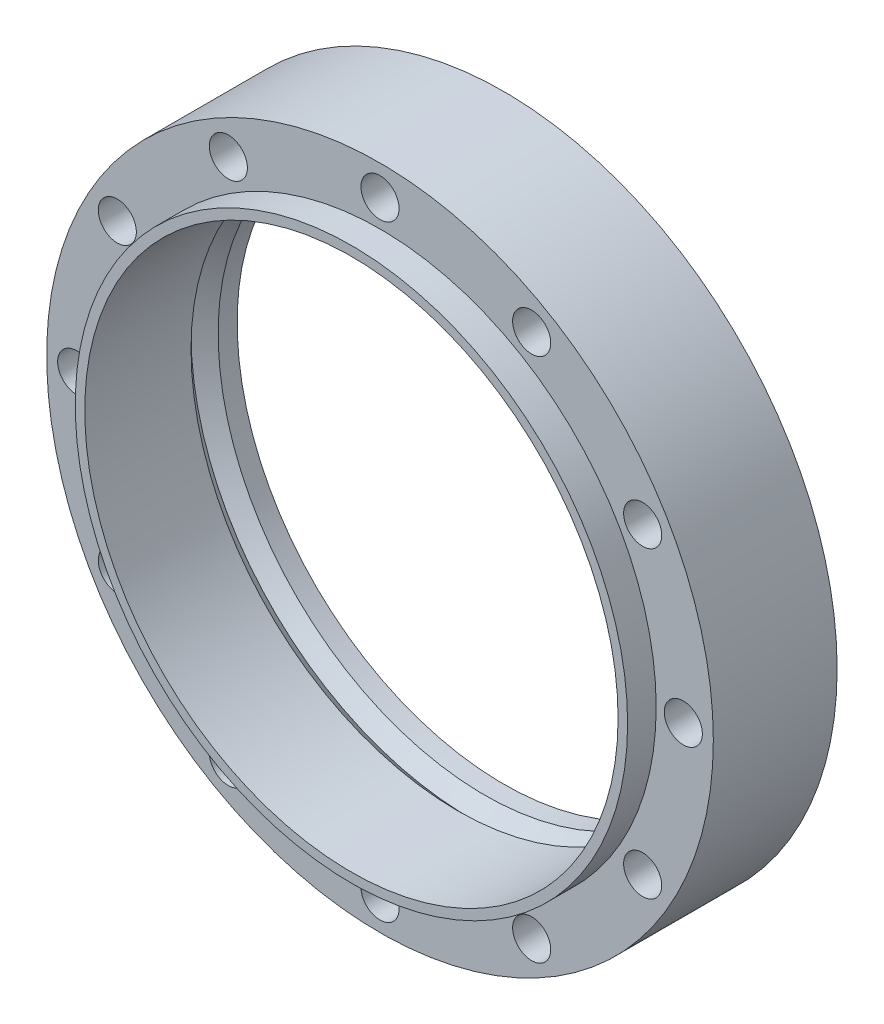
ISO-10303-21;
HEADER;
FILE_DESCRIPTION(('STEP AP214'),'2;1');
FILE_NAME('part.step','',(''),(''),'','','');
FILE_SCHEMA(('AUTOMOTIVE_DESIGN { 1 0 10303 214 1 1 1 1 }'));
ENDSEC;
DATA;
#1=APPLICATION_CONTEXT('core data for automotive mechanical design processes');
#2=APPLICATION_PROTOCOL_DEFINITION('international standard','automotive_design',2000,#1);
#3=PRODUCT_CONTEXT('',#1,'mechanical');
#4=PRODUCT('Part','Part','',(#3));
#5=PRODUCT_RELATED_PRODUCT_CATEGORY('part','',(#4));
#6=PRODUCT_DEFINITION_FORMATION('','',#4);
#7=PRODUCT_DEFINITION_CONTEXT('part definition',#1,'design');
#8=PRODUCT_DEFINITION('design','',#6,#7);
#9=PRODUCT_DEFINITION_SHAPE('','',#8);
#10=(LENGTH_UNIT() NAMED_UNIT(*) SI_UNIT(.MILLI.,.METRE.));
#11=(NAMED_UNIT(*) PLANE_ANGLE_UNIT() SI_UNIT($,.RADIAN.));
#12=(NAMED_UNIT(*) SI_UNIT($,.STERADIAN.) SOLID_ANGLE_UNIT());
#13=UNCERTAINTY_MEASURE_WITH_UNIT(LENGTH_MEASURE(1.E-05),#10,'distance_accuracy_value','');
#14=(GEOMETRIC_REPRESENTATION_CONTEXT(3) GLOBAL_UNCERTAINTY_ASSIGNED_CONTEXT((#13)) GLOBAL_UNIT_ASSIGNED_CONTEXT((#10,
#11,#12)) REPRESENTATION_CONTEXT('',''));
#15=CARTESIAN_POINT('',(0.,0.,0.));
#16=DIRECTION('',(0.,0.,1.));
#17=DIRECTION('',(1.,0.,0.));
#18=AXIS2_PLACEMENT_3D('',#15,#16,#17);
#19=CARTESIAN_POINT('',(0.,0.,0.));
#20=DIRECTION('',(0.,0.,1.));
#21=DIRECTION('',(1.,0.,0.));
#22=AXIS2_PLACEMENT_3D('',#19,#20,#21);
#23=CYLINDRICAL_SURFACE('',#22,28.);
#24=CARTESIAN_POINT('',(0.,0.,1.99632689504756));
#25=DIRECTION('',(0.,0.,1.));
#26=DIRECTION('',(1.,0.,0.));
#27=AXIS2_PLACEMENT_3D('',#24,#25,#26);
#28=CIRCLE('',#27,28.);
#29=CARTESIAN_POINT('',(28.,0.,1.99632689504756));
#30=VERTEX_POINT('',#29);
#31=EDGE_CURVE('E36',#30,#30,#28,.T.);
#32=ORIENTED_EDGE('',*,*,#31,.T.);
#33=EDGE_LOOP('',(#32));
#34=FACE_BOUND('',#33,.T.);
#35=CARTESIAN_POINT('',(0.,0.,0.));
#36=DIRECTION('',(0.,0.,1.));
#37=DIRECTION('',(1.,0.,0.));
#38=AXIS2_PLACEMENT_3D('',#35,#36,#37);
#39=CIRCLE('',#38,28.);
#40=CARTESIAN_POINT('',(28.,0.,0.));
#41=VERTEX_POINT('',#40);
#42=EDGE_CURVE('E132',#41,#41,#39,.T.);
#43=ORIENTED_EDGE('',*,*,#42,.F.);
#44=EDGE_LOOP('',(#43));
#45=FACE_BOUND('',#44,.T.);
#46=ADVANCED_FACE('F32',(#34,#45),#23,.F.);
#47=CARTESIAN_POINT('',(0.,0.,16.));
#48=DIRECTION('',(0.,0.,-1.));
#49=DIRECTION('',(-1.,0.,0.));
#50=AXIS2_PLACEMENT_3D('',#47,#48,#49);
#51=CYLINDRICAL_SURFACE('',#50,35.);
#52=CARTESIAN_POINT('',(0.,0.,0.));
#53=DIRECTION('',(0.,0.,1.));
#54=DIRECTION('',(1.,0.,0.));
#55=AXIS2_PLACEMENT_3D('',#52,#53,#54);
#56=CIRCLE('',#55,35.);
#57=CARTESIAN_POINT('',(35.,0.,0.));
#58=VERTEX_POINT('',#57);
#59=EDGE_CURVE('E10',#58,#58,#56,.T.);
#60=ORIENTED_EDGE('',*,*,#59,.T.);
#61=EDGE_LOOP('',(#60));
#62=FACE_BOUND('',#61,.T.);
#63=CARTESIAN_POINT('',(0.,0.,13.));
#64=DIRECTION('',(0.,0.,1.));
#65=DIRECTION('',(1.,0.,0.));
#66=AXIS2_PLACEMENT_3D('',#63,#64,#65);
#67=CIRCLE('',#66,35.);
#68=CARTESIAN_POINT('',(35.,0.,13.));
#69=VERTEX_POINT('',#68);
#70=EDGE_CURVE('E40',#69,#69,#67,.T.);
#71=ORIENTED_EDGE('',*,*,#70,.F.);
#72=EDGE_LOOP('',(#71));
#73=FACE_BOUND('',#72,.T.);
#74=ADVANCED_FACE('F34',(#62,#73),#51,.T.);
#75=CARTESIAN_POINT('',(0.,0.,0.));
#76=DIRECTION('',(0.,0.,1.));
#77=DIRECTION('',(1.,0.,0.));
#78=AXIS2_PLACEMENT_3D('',#75,#76,#77);
#79=PLANE('',#78);
#80=CARTESIAN_POINT('',(-15.9239453357097,27.5810823783995,0.));
#81=DIRECTION('',(0.,0.,1.));
#82=DIRECTION('',(0.866025403784445,0.499999999999989,0.));
#83=AXIS2_PLACEMENT_3D('',#80,#81,#82);
#84=CIRCLE('',#83,2.);
#85=CARTESIAN_POINT('',(-14.1918945281408,28.5810823783995,0.));
#86=VERTEX_POINT('',#85);
#87=EDGE_CURVE('E54',#86,#86,#84,.T.);
#88=ORIENTED_EDGE('',*,*,#87,.T.);
#89=EDGE_LOOP('',(#88));
#90=FACE_BOUND('',#89,.T.);
#91=CARTESIAN_POINT('',(-27.5810823783991,15.9239453357104,0.));
#92=DIRECTION('',(0.,0.,1.));
#93=DIRECTION('',(0.50000000000001,0.866025403784433,0.));
#94=AXIS2_PLACEMENT_3D('',#91,#92,#93);
#95=CIRCLE('',#94,2.);
#96=CARTESIAN_POINT('',(-26.5810823783991,17.6559961432792,0.));
#97=VERTEX_POINT('',#96);
#98=EDGE_CURVE('E65',#97,#97,#95,.T.);
#99=ORIENTED_EDGE('',*,*,#98,.T.);
#100=EDGE_LOOP('',(#99));
#101=FACE_BOUND('',#100,.T.);
#102=CARTESIAN_POINT('',(-31.8478906714201,3.33588947882339E-13,0.));
#103=DIRECTION('',(0.,0.,1.));
#104=DIRECTION('',(0.,1.,0.));
#105=AXIS2_PLACEMENT_3D('',#102,#103,#104);
#106=CIRCLE('',#105,2.);
#107=CARTESIAN_POINT('',(-31.8478906714201,2.00000000000033,0.));
#108=VERTEX_POINT('',#107);
#109=EDGE_CURVE('E71',#108,#108,#106,.T.);
#110=ORIENTED_EDGE('',*,*,#109,.T.);
#111=EDGE_LOOP('',(#110));
#112=FACE_BOUND('',#111,.T.);
#113=CARTESIAN_POINT('',(-27.5810823783994,-15.9239453357098,0.));
#114=DIRECTION('',(0.,0.,1.));
#115=DIRECTION('',(-0.499999999999992,0.866025403784443,0.));
#116=AXIS2_PLACEMENT_3D('',#113,#114,#115);
#117=CIRCLE('',#116,2.);
#118=CARTESIAN_POINT('',(-28.5810823783994,-14.1918945281409,0.));
#119=VERTEX_POINT('',#118);
#120=EDGE_CURVE('E77',#119,#119,#117,.T.);
#121=ORIENTED_EDGE('',*,*,#120,.T.);
#122=EDGE_LOOP('',(#121));
#123=FACE_BOUND('',#122,.T.);
#124=CARTESIAN_POINT('',(-15.9239453357103,-27.5810823783991,0.));
#125=DIRECTION('',(0.,0.,1.));
#126=DIRECTION('',(-0.866025403784435,0.500000000000007,0.));
#127=AXIS2_PLACEMENT_3D('',#124,#125,#126);
#128=CIRCLE('',#127,2.);
#129=CARTESIAN_POINT('',(-17.6559961432792,-26.5810823783991,0.));
#130=VERTEX_POINT('',#129);
#131=EDGE_CURVE('E83',#130,#130,#128,.T.);
#132=ORIENTED_EDGE('',*,*,#131,.T.);
#133=EDGE_LOOP('',(#132));
#134=FACE_BOUND('',#133,.T.);
#135=CARTESIAN_POINT('',(0.,-31.8478906714201,0.));
#136=DIRECTION('',(0.,0.,1.));
#137=DIRECTION('',(-1.,0.,0.));
#138=AXIS2_PLACEMENT_3D('',#135,#136,#137);
#139=CIRCLE('',#138,2.);
#140=CARTESIAN_POINT('',(-2.,-31.8478906714201,0.));
#141=VERTEX_POINT('',#140);
#142=EDGE_CURVE('E89',#141,#141,#139,.T.);
#143=ORIENTED_EDGE('',*,*,#142,.T.);
#144=EDGE_LOOP('',(#143));
#145=FACE_BOUND('',#144,.T.);
#146=CARTESIAN_POINT('',(15.9239453357099,-27.5810823783994,0.));
#147=DIRECTION('',(0.,0.,1.));
#148=DIRECTION('',(-0.866025403784442,-0.499999999999995,0.));
#149=AXIS2_PLACEMENT_3D('',#146,#147,#148);
#150=CIRCLE('',#149,2.);
#151=CARTESIAN_POINT('',(14.191894528141,-28.5810823783994,0.));
#152=VERTEX_POINT('',#151);
#153=EDGE_CURVE('E95',#152,#152,#150,.T.);
#154=ORIENTED_EDGE('',*,*,#153,.T.);
#155=EDGE_LOOP('',(#154));
#156=FACE_BOUND('',#155,.T.);
#157=CARTESIAN_POINT('',(27.5810823783992,-15.9239453357102,0.));
#158=DIRECTION('',(0.,0.,1.));
#159=DIRECTION('',(-0.500000000000004,-0.866025403784436,0.));
#160=AXIS2_PLACEMENT_3D('',#157,#158,#159);
#161=CIRCLE('',#160,2.);
#162=CARTESIAN_POINT('',(26.5810823783992,-17.6559961432791,0.));
#163=VERTEX_POINT('',#162);
#164=EDGE_CURVE('E101',#163,#163,#161,.T.);
#165=ORIENTED_EDGE('',*,*,#164,.T.);
#166=EDGE_LOOP('',(#165));
#167=FACE_BOUND('',#166,.T.);
#168=CARTESIAN_POINT('',(31.8478906714201,-1.1119631596078E-13,0.));
#169=DIRECTION('',(0.,0.,1.));
#170=DIRECTION('',(0.,-1.,0.));
#171=AXIS2_PLACEMENT_3D('',#168,#169,#170);
#172=CIRCLE('',#171,2.);
#173=CARTESIAN_POINT('',(31.8478906714201,-2.00000000000011,0.));
#174=VERTEX_POINT('',#173);
#175=EDGE_CURVE('E107',#174,#174,#172,.T.);
#176=ORIENTED_EDGE('',*,*,#175,.T.);
#177=EDGE_LOOP('',(#176));
#178=FACE_BOUND('',#177,.T.);
#179=CARTESIAN_POINT('',(27.5810823783993,15.92394533571,0.));
#180=DIRECTION('',(0.,0.,1.));
#181=DIRECTION('',(0.499999999999998,-0.86602540378444,0.));
#182=AXIS2_PLACEMENT_3D('',#179,#180,#181);
#183=CIRCLE('',#182,2.);
#184=CARTESIAN_POINT('',(28.5810823783993,14.1918945281411,0.));
#185=VERTEX_POINT('',#184);
#186=EDGE_CURVE('E113',#185,#185,#183,.T.);
#187=ORIENTED_EDGE('',*,*,#186,.T.);
#188=EDGE_LOOP('',(#187));
#189=FACE_BOUND('',#188,.T.);
#190=CARTESIAN_POINT('',(15.9239453357101,27.5810823783992,0.));
#191=DIRECTION('',(0.,0.,1.));
#192=DIRECTION('',(0.866025403784438,-0.500000000000001,0.));
#193=AXIS2_PLACEMENT_3D('',#190,#191,#192);
#194=CIRCLE('',#193,2.);
#195=CARTESIAN_POINT('',(17.655996143279,26.5810823783992,0.));
#196=VERTEX_POINT('',#195);
#197=EDGE_CURVE('E119',#196,#196,#194,.T.);
#198=ORIENTED_EDGE('',*,*,#197,.T.);
#199=EDGE_LOOP('',(#198));
#200=FACE_BOUND('',#199,.T.);
#201=CARTESIAN_POINT('',(0.,31.8478906714201,0.));
#202=DIRECTION('',(0.,0.,1.));
#203=DIRECTION('',(1.,0.,0.));
#204=AXIS2_PLACEMENT_3D('',#201,#202,#203);
#205=CIRCLE('',#204,2.);
#206=CARTESIAN_POINT('',(2.,31.8478906714201,0.));
#207=VERTEX_POINT('',#206);
#208=EDGE_CURVE('E126',#207,#207,#205,.T.);
#209=ORIENTED_EDGE('',*,*,#208,.T.);
#210=EDGE_LOOP('',(#209));
#211=FACE_BOUND('',#210,.T.);
#212=ORIENTED_EDGE('',*,*,#42,.T.);
#213=EDGE_LOOP('',(#212));
#214=FACE_BOUND('',#213,.T.);
#215=ORIENTED_EDGE('',*,*,#59,.F.);
#216=EDGE_LOOP('',(#215));
#217=FACE_BOUND('',#216,.T.);
#218=ADVANCED_FACE('F156',(#90,#101,#112,#123,#134,#145,#156,#167,#178,#189,#200,#211,#214,
#217),#79,.F.);
#219=CARTESIAN_POINT('',(0.,0.,13.));
#220=DIRECTION('',(0.,0.,1.));
#221=DIRECTION('',(1.,0.,0.));
#222=AXIS2_PLACEMENT_3D('',#219,#220,#221);
#223=PLANE('',#222);
#224=CARTESIAN_POINT('',(-15.9239453357097,27.5810823783995,13.));
#225=DIRECTION('',(0.,0.,1.));
#226=DIRECTION('',(0.866025403784445,0.499999999999989,0.));
#227=AXIS2_PLACEMENT_3D('',#224,#225,#226);
#228=CIRCLE('',#227,2.);
#229=CARTESIAN_POINT('',(-14.1918945281408,28.5810823783995,13.));
#230=VERTEX_POINT('',#229);
#231=EDGE_CURVE('E62',#230,#230,#228,.T.);
#232=ORIENTED_EDGE('',*,*,#231,.F.);
#233=EDGE_LOOP('',(#232));
#234=FACE_BOUND('',#233,.T.);
#235=CARTESIAN_POINT('',(-27.5810823783991,15.9239453357104,13.));
#236=DIRECTION('',(0.,0.,1.));
#237=DIRECTION('',(0.50000000000001,0.866025403784433,0.));
#238=AXIS2_PLACEMENT_3D('',#235,#236,#237);
#239=CIRCLE('',#238,2.);
#240=CARTESIAN_POINT('',(-26.5810823783991,17.6559961432792,13.));
#241=VERTEX_POINT('',#240);
#242=EDGE_CURVE('E68',#241,#241,#239,.T.);
#243=ORIENTED_EDGE('',*,*,#242,.F.);
#244=EDGE_LOOP('',(#243));
#245=FACE_BOUND('',#244,.T.);
#246=CARTESIAN_POINT('',(-31.8478906714201,3.33588947882339E-13,13.));
#247=DIRECTION('',(0.,0.,1.));
#248=DIRECTION('',(0.,1.,0.));
#249=AXIS2_PLACEMENT_3D('',#246,#247,#248);
#250=CIRCLE('',#249,2.);
#251=CARTESIAN_POINT('',(-31.8478906714201,2.00000000000033,13.));
#252=VERTEX_POINT('',#251);
#253=EDGE_CURVE('E74',#252,#252,#250,.T.);
#254=ORIENTED_EDGE('',*,*,#253,.F.);
#255=EDGE_LOOP('',(#254));
#256=FACE_BOUND('',#255,.T.);
#257=CARTESIAN_POINT('',(-27.5810823783994,-15.9239453357098,13.));
#258=DIRECTION('',(0.,0.,1.));
#259=DIRECTION('',(-0.499999999999992,0.866025403784443,0.));
#260=AXIS2_PLACEMENT_3D('',#257,#258,#259);
#261=CIRCLE('',#260,2.);
#262=CARTESIAN_POINT('',(-28.5810823783994,-14.1918945281409,13.));
#263=VERTEX_POINT('',#262);
#264=EDGE_CURVE('E80',#263,#263,#261,.T.);
#265=ORIENTED_EDGE('',*,*,#264,.F.);
#266=EDGE_LOOP('',(#265));
#267=FACE_BOUND('',#266,.T.);
#268=CARTESIAN_POINT('',(-15.9239453357103,-27.5810823783991,13.));
#269=DIRECTION('',(0.,0.,1.));
#270=DIRECTION('',(-0.866025403784435,0.500000000000007,0.));
#271=AXIS2_PLACEMENT_3D('',#268,#269,#270);
#272=CIRCLE('',#271,2.);
#273=CARTESIAN_POINT('',(-17.6559961432792,-26.5810823783991,13.));
#274=VERTEX_POINT('',#273);
#275=EDGE_CURVE('E86',#274,#274,#272,.T.);
#276=ORIENTED_EDGE('',*,*,#275,.F.);
#277=EDGE_LOOP('',(#276));
#278=FACE_BOUND('',#277,.T.);
#279=CARTESIAN_POINT('',(0.,-31.8478906714201,13.));
#280=DIRECTION('',(0.,0.,1.));
#281=DIRECTION('',(-1.,0.,0.));
#282=AXIS2_PLACEMENT_3D('',#279,#280,#281);
#283=CIRCLE('',#282,2.);
#284=CARTESIAN_POINT('',(-2.,-31.8478906714201,13.));
#285=VERTEX_POINT('',#284);
#286=EDGE_CURVE('E92',#285,#285,#283,.T.);
#287=ORIENTED_EDGE('',*,*,#286,.F.);
#288=EDGE_LOOP('',(#287));
#289=FACE_BOUND('',#288,.T.);
#290=CARTESIAN_POINT('',(15.9239453357099,-27.5810823783994,13.));
#291=DIRECTION('',(0.,0.,1.));
#292=DIRECTION('',(-0.866025403784442,-0.499999999999995,0.));
#293=AXIS2_PLACEMENT_3D('',#290,#291,#292);
#294=CIRCLE('',#293,2.);
#295=CARTESIAN_POINT('',(14.191894528141,-28.5810823783994,13.));
#296=VERTEX_POINT('',#295);
#297=EDGE_CURVE('E98',#296,#296,#294,.T.);
#298=ORIENTED_EDGE('',*,*,#297,.F.);
#299=EDGE_LOOP('',(#298));
#300=FACE_BOUND('',#299,.T.);
#301=CARTESIAN_POINT('',(27.5810823783992,-15.9239453357102,13.));
#302=DIRECTION('',(0.,0.,1.));
#303=DIRECTION('',(-0.500000000000004,-0.866025403784436,0.));
#304=AXIS2_PLACEMENT_3D('',#301,#302,#303);
#305=CIRCLE('',#304,2.);
#306=CARTESIAN_POINT('',(26.5810823783992,-17.6559961432791,13.));
#307=VERTEX_POINT('',#306);
#308=EDGE_CURVE('E104',#307,#307,#305,.T.);
#309=ORIENTED_EDGE('',*,*,#308,.F.);
#310=EDGE_LOOP('',(#309));
#311=FACE_BOUND('',#310,.T.);
#312=CARTESIAN_POINT('',(31.8478906714201,-1.1119631596078E-13,13.));
#313=DIRECTION('',(0.,0.,1.));
#314=DIRECTION('',(0.,-1.,0.));
#315=AXIS2_PLACEMENT_3D('',#312,#313,#314);
#316=CIRCLE('',#315,2.);
#317=CARTESIAN_POINT('',(31.8478906714201,-2.00000000000011,13.));
#318=VERTEX_POINT('',#317);
#319=EDGE_CURVE('E110',#318,#318,#316,.T.);
#320=ORIENTED_EDGE('',*,*,#319,.F.);
#321=EDGE_LOOP('',(#320));
#322=FACE_BOUND('',#321,.T.);
#323=CARTESIAN_POINT('',(27.5810823783993,15.92394533571,13.));
#324=DIRECTION('',(0.,0.,1.));
#325=DIRECTION('',(0.499999999999998,-0.86602540378444,0.));
#326=AXIS2_PLACEMENT_3D('',#323,#324,#325);
#327=CIRCLE('',#326,2.);
#328=CARTESIAN_POINT('',(28.5810823783993,14.1918945281411,13.));
#329=VERTEX_POINT('',#328);
#330=EDGE_CURVE('E116',#329,#329,#327,.T.);
#331=ORIENTED_EDGE('',*,*,#330,.F.);
#332=EDGE_LOOP('',(#331));
#333=FACE_BOUND('',#332,.T.);
#334=CARTESIAN_POINT('',(15.9239453357101,27.5810823783992,13.));
#335=DIRECTION('',(0.,0.,1.));
#336=DIRECTION('',(0.866025403784438,-0.500000000000001,0.));
#337=AXIS2_PLACEMENT_3D('',#334,#335,#336);
#338=CIRCLE('',#337,2.);
#339=CARTESIAN_POINT('',(17.655996143279,26.5810823783992,13.));
#340=VERTEX_POINT('',#339);
#341=EDGE_CURVE('E122',#340,#340,#338,.T.);
#342=ORIENTED_EDGE('',*,*,#341,.F.);
#343=EDGE_LOOP('',(#342));
#344=FACE_BOUND('',#343,.T.);
#345=CARTESIAN_POINT('',(0.,31.8478906714201,13.));
#346=DIRECTION('',(0.,0.,1.));
#347=DIRECTION('',(1.,0.,0.));
#348=AXIS2_PLACEMENT_3D('',#345,#346,#347);
#349=CIRCLE('',#348,2.);
#350=CARTESIAN_POINT('',(2.,31.8478906714201,13.));
#351=VERTEX_POINT('',#350);
#352=EDGE_CURVE('E125',#351,#351,#349,.T.);
#353=ORIENTED_EDGE('',*,*,#352,.F.);
#354=EDGE_LOOP('',(#353));
#355=FACE_BOUND('',#354,.T.);
#356=CARTESIAN_POINT('',(0.,0.,13.));
#357=DIRECTION('',(0.,0.,1.));
#358=DIRECTION('',(1.,0.,0.));
#359=AXIS2_PLACEMENT_3D('',#356,#357,#358);
#360=CIRCLE('',#359,29.);
#361=CARTESIAN_POINT('',(29.,0.,13.));
#362=VERTEX_POINT('',#361);
#363=EDGE_CURVE('E45',#362,#362,#360,.T.);
#364=ORIENTED_EDGE('',*,*,#363,.F.);
#365=EDGE_LOOP('',(#364));
#366=FACE_BOUND('',#365,.T.);
#367=ORIENTED_EDGE('',*,*,#70,.T.);
#368=EDGE_LOOP('',(#367));
#369=FACE_BOUND('',#368,.T.);
#370=ADVANCED_FACE('F146',(#234,#245,#256,#267,#278,#289,#300,#311,#322,#333,#344,#355,#366,
#369),#223,.T.);
#371=CARTESIAN_POINT('',(0.,0.,13.));
#372=DIRECTION('',(0.,0.,1.));
#373=DIRECTION('',(1.,0.,0.));
#374=AXIS2_PLACEMENT_3D('',#371,#372,#373);
#375=CYLINDRICAL_SURFACE('',#374,29.);
#376=ORIENTED_EDGE('',*,*,#363,.T.);
#377=EDGE_LOOP('',(#376));
#378=FACE_BOUND('',#377,.T.);
#379=CARTESIAN_POINT('',(0.,0.,16.));
#380=DIRECTION('',(0.,0.,1.));
#381=DIRECTION('',(1.,0.,0.));
#382=AXIS2_PLACEMENT_3D('',#379,#380,#381);
#383=CIRCLE('',#382,29.);
#384=CARTESIAN_POINT('',(29.,0.,16.));
#385=VERTEX_POINT('',#384);
#386=EDGE_CURVE('E135',#385,#385,#383,.T.);
#387=ORIENTED_EDGE('',*,*,#386,.F.);
#388=EDGE_LOOP('',(#387));
#389=FACE_BOUND('',#388,.T.);
#390=ADVANCED_FACE('F144',(#378,#389),#375,.T.);
#391=CARTESIAN_POINT('',(0.,0.,16.));
#392=DIRECTION('',(0.,0.,1.));
#393=DIRECTION('',(1.,0.,0.));
#394=AXIS2_PLACEMENT_3D('',#391,#392,#393);
#395=PLANE('',#394);
#396=CARTESIAN_POINT('',(0.,0.,16.));
#397=DIRECTION('',(0.,0.,1.));
#398=DIRECTION('',(1.,0.,0.));
#399=AXIS2_PLACEMENT_3D('',#396,#397,#398);
#400=CIRCLE('',#399,28.);
#401=CARTESIAN_POINT('',(28.,0.,16.));
#402=VERTEX_POINT('',#401);
#403=EDGE_CURVE('E129',#402,#402,#400,.T.);
#404=ORIENTED_EDGE('',*,*,#403,.F.);
#405=EDGE_LOOP('',(#404));
#406=FACE_BOUND('',#405,.T.);
#407=ORIENTED_EDGE('',*,*,#386,.T.);
#408=EDGE_LOOP('',(#407));
#409=FACE_BOUND('',#408,.T.);
#410=ADVANCED_FACE('F142',(#406,#409),#395,.T.);
#411=CARTESIAN_POINT('',(0.,0.,4.84352488668674));
#412=DIRECTION('',(0.,0.,-1.));
#413=DIRECTION('',(-1.,0.,0.));
#414=AXIS2_PLACEMENT_3D('',#411,#412,#413);
#415=CIRCLE('',#414,28.);
#416=CARTESIAN_POINT('',(-28.,0.,4.84352488668674));
#417=VERTEX_POINT('',#416);
#418=EDGE_CURVE('E48',#417,#417,#415,.T.);
#419=ORIENTED_EDGE('',*,*,#418,.T.);
#420=EDGE_LOOP('',(#419));
#421=FACE_BOUND('',#420,.T.);
#422=ORIENTED_EDGE('',*,*,#403,.T.);
#423=EDGE_LOOP('',(#422));
#424=FACE_BOUND('',#423,.T.);
#425=ADVANCED_FACE('F153',(#421,#424),#23,.F.);
#426=CARTESIAN_POINT('',(0.,31.8478906714201,0.));
#427=DIRECTION('',(0.,0.,1.));
#428=DIRECTION('',(1.,0.,0.));
#429=AXIS2_PLACEMENT_3D('',#426,#427,#428);
#430=CYLINDRICAL_SURFACE('',#429,2.);
#431=ORIENTED_EDGE('',*,*,#208,.F.);
#432=EDGE_LOOP('',(#431));
#433=FACE_BOUND('',#432,.T.);
#434=ORIENTED_EDGE('',*,*,#352,.T.);
#435=EDGE_LOOP('',(#434));
#436=FACE_BOUND('',#435,.T.);
#437=ADVANCED_FACE('F168',(#433,#436),#430,.F.);
#438=CARTESIAN_POINT('',(15.9239453357101,27.5810823783992,0.));
#439=DIRECTION('',(0.,0.,1.));
#440=DIRECTION('',(0.866025403784438,-0.500000000000001,0.));
#441=AXIS2_PLACEMENT_3D('',#438,#439,#440);
#442=CYLINDRICAL_SURFACE('',#441,2.);
#443=ORIENTED_EDGE('',*,*,#197,.F.);
#444=EDGE_LOOP('',(#443));
#445=FACE_BOUND('',#444,.T.);
#446=ORIENTED_EDGE('',*,*,#341,.T.);
#447=EDGE_LOOP('',(#446));
#448=FACE_BOUND('',#447,.T.);
#449=ADVANCED_FACE('F172',(#445,#448),#442,.F.);
#450=CARTESIAN_POINT('',(27.5810823783993,15.92394533571,0.));
#451=DIRECTION('',(0.,0.,1.));
#452=DIRECTION('',(0.499999999999998,-0.86602540378444,0.));
#453=AXIS2_PLACEMENT_3D('',#450,#451,#452);
#454=CYLINDRICAL_SURFACE('',#453,2.);
#455=ORIENTED_EDGE('',*,*,#186,.F.);
#456=EDGE_LOOP('',(#455));
#457=FACE_BOUND('',#456,.T.);
#458=ORIENTED_EDGE('',*,*,#330,.T.);
#459=EDGE_LOOP('',(#458));
#460=FACE_BOUND('',#459,.T.);
#461=ADVANCED_FACE('F179',(#457,#460),#454,.F.);
#462=CARTESIAN_POINT('',(31.8478906714201,-1.1119631596078E-13,0.));
#463=DIRECTION('',(0.,0.,1.));
#464=DIRECTION('',(0.,-1.,0.));
#465=AXIS2_PLACEMENT_3D('',#462,#463,#464);
#466=CYLINDRICAL_SURFACE('',#465,2.);
#467=ORIENTED_EDGE('',*,*,#175,.F.);
#468=EDGE_LOOP('',(#467));
#469=FACE_BOUND('',#468,.T.);
#470=ORIENTED_EDGE('',*,*,#319,.T.);
#471=EDGE_LOOP('',(#470));
#472=FACE_BOUND('',#471,.T.);
#473=ADVANCED_FACE('F187',(#469,#472),#466,.F.);
#474=CARTESIAN_POINT('',(27.5810823783992,-15.9239453357102,0.));
#475=DIRECTION('',(0.,0.,1.));
#476=DIRECTION('',(-0.500000000000004,-0.866025403784436,0.));
#477=AXIS2_PLACEMENT_3D('',#474,#475,#476);
#478=CYLINDRICAL_SURFACE('',#477,2.);
#479=ORIENTED_EDGE('',*,*,#164,.F.);
#480=EDGE_LOOP('',(#479));
#481=FACE_BOUND('',#480,.T.);
#482=ORIENTED_EDGE('',*,*,#308,.T.);
#483=EDGE_LOOP('',(#482));
#484=FACE_BOUND('',#483,.T.);
#485=ADVANCED_FACE('F191',(#481,#484),#478,.F.);
#486=CARTESIAN_POINT('',(15.9239453357099,-27.5810823783994,0.));
#487=DIRECTION('',(0.,0.,1.));
#488=DIRECTION('',(-0.866025403784442,-0.499999999999995,0.));
#489=AXIS2_PLACEMENT_3D('',#486,#487,#488);
#490=CYLINDRICAL_SURFACE('',#489,2.);
#491=ORIENTED_EDGE('',*,*,#153,.F.);
#492=EDGE_LOOP('',(#491));
#493=FACE_BOUND('',#492,.T.);
#494=ORIENTED_EDGE('',*,*,#297,.T.);
#495=EDGE_LOOP('',(#494));
#496=FACE_BOUND('',#495,.T.);
#497=ADVANCED_FACE('F195',(#493,#496),#490,.F.);
#498=CARTESIAN_POINT('',(0.,-31.8478906714201,0.));
#499=DIRECTION('',(0.,0.,1.));
#500=DIRECTION('',(-1.,0.,0.));
#501=AXIS2_PLACEMENT_3D('',#498,#499,#500);
#502=CYLINDRICAL_SURFACE('',#501,2.);
#503=ORIENTED_EDGE('',*,*,#142,.F.);
#504=EDGE_LOOP('',(#503));
#505=FACE_BOUND('',#504,.T.);
#506=ORIENTED_EDGE('',*,*,#286,.T.);
#507=EDGE_LOOP('',(#506));
#508=FACE_BOUND('',#507,.T.);
#509=ADVANCED_FACE('F199',(#505,#508),#502,.F.);
#510=CARTESIAN_POINT('',(-15.9239453357103,-27.5810823783991,0.));
#511=DIRECTION('',(0.,0.,1.));
#512=DIRECTION('',(-0.866025403784435,0.500000000000007,0.));
#513=AXIS2_PLACEMENT_3D('',#510,#511,#512);
#514=CYLINDRICAL_SURFACE('',#513,2.);
#515=ORIENTED_EDGE('',*,*,#131,.F.);
#516=EDGE_LOOP('',(#515));
#517=FACE_BOUND('',#516,.T.);
#518=ORIENTED_EDGE('',*,*,#275,.T.);
#519=EDGE_LOOP('',(#518));
#520=FACE_BOUND('',#519,.T.);
#521=ADVANCED_FACE('F203',(#517,#520),#514,.F.);
#522=CARTESIAN_POINT('',(-27.5810823783994,-15.9239453357098,0.));
#523=DIRECTION('',(0.,0.,1.));
#524=DIRECTION('',(-0.499999999999992,0.866025403784443,0.));
#525=AXIS2_PLACEMENT_3D('',#522,#523,#524);
#526=CYLINDRICAL_SURFACE('',#525,2.);
#527=ORIENTED_EDGE('',*,*,#120,.F.);
#528=EDGE_LOOP('',(#527));
#529=FACE_BOUND('',#528,.T.);
#530=ORIENTED_EDGE('',*,*,#264,.T.);
#531=EDGE_LOOP('',(#530));
#532=FACE_BOUND('',#531,.T.);
#533=ADVANCED_FACE('F207',(#529,#532),#526,.F.);
#534=CARTESIAN_POINT('',(-31.8478906714201,3.33588947882339E-13,0.));
#535=DIRECTION('',(0.,0.,1.));
#536=DIRECTION('',(0.,1.,0.));
#537=AXIS2_PLACEMENT_3D('',#534,#535,#536);
#538=CYLINDRICAL_SURFACE('',#537,2.);
#539=ORIENTED_EDGE('',*,*,#109,.F.);
#540=EDGE_LOOP('',(#539));
#541=FACE_BOUND('',#540,.T.);
#542=ORIENTED_EDGE('',*,*,#253,.T.);
#543=EDGE_LOOP('',(#542));
#544=FACE_BOUND('',#543,.T.);
#545=ADVANCED_FACE('F211',(#541,#544),#538,.F.);
#546=CARTESIAN_POINT('',(-27.5810823783991,15.9239453357104,0.));
#547=DIRECTION('',(0.,0.,1.));
#548=DIRECTION('',(0.50000000000001,0.866025403784433,0.));
#549=AXIS2_PLACEMENT_3D('',#546,#547,#548);
#550=CYLINDRICAL_SURFACE('',#549,2.);
#551=ORIENTED_EDGE('',*,*,#98,.F.);
#552=EDGE_LOOP('',(#551));
#553=FACE_BOUND('',#552,.T.);
#554=ORIENTED_EDGE('',*,*,#242,.T.);
#555=EDGE_LOOP('',(#554));
#556=FACE_BOUND('',#555,.T.);
#557=ADVANCED_FACE('F215',(#553,#556),#550,.F.);
#558=CARTESIAN_POINT('',(-15.9239453357097,27.5810823783995,0.));
#559=DIRECTION('',(0.,0.,1.));
#560=DIRECTION('',(0.866025403784445,0.499999999999989,0.));
#561=AXIS2_PLACEMENT_3D('',#558,#559,#560);
#562=CYLINDRICAL_SURFACE('',#561,2.);
#563=ORIENTED_EDGE('',*,*,#87,.F.);
#564=EDGE_LOOP('',(#563));
#565=FACE_BOUND('',#564,.T.);
#566=ORIENTED_EDGE('',*,*,#231,.T.);
#567=EDGE_LOOP('',(#566));
#568=FACE_BOUND('',#567,.T.);
#569=ADVANCED_FACE('F219',(#565,#568),#562,.F.);
#570=CARTESIAN_POINT('',(0.,0.,1.98280477994217));
#571=DIRECTION('',(0.,0.,1.));
#572=DIRECTION('',(1.,0.,0.));
#573=AXIS2_PLACEMENT_3D('',#570,#571,#572);
#574=CONICAL_SURFACE('',#573,27.9864778848946,0.785398163397449);
#575=CARTESIAN_POINT('',(0.,0.,3.41992589086715));
#576=DIRECTION('',(0.,0.,-1.));
#577=DIRECTION('',(-1.,0.,0.));
#578=AXIS2_PLACEMENT_3D('',#575,#576,#577);
#579=CIRCLE('',#578,29.4235989958196);
#580=CARTESIAN_POINT('',(-29.4235989958196,0.,3.41992589086715));
#581=VERTEX_POINT('',#580);
#582=EDGE_CURVE('E50',#581,#581,#579,.T.);
#583=ORIENTED_EDGE('',*,*,#582,.F.);
#584=EDGE_LOOP('',(#583));
#585=FACE_BOUND('',#584,.T.);
#586=ORIENTED_EDGE('',*,*,#31,.F.);
#587=EDGE_LOOP('',(#586));
#588=FACE_BOUND('',#587,.T.);
#589=ADVANCED_FACE('F223',(#585,#588),#574,.F.);
#590=CARTESIAN_POINT('',(0.,0.,3.41992589086715));
#591=DIRECTION('',(0.,0.,-1.));
#592=DIRECTION('',(-1.,0.,0.));
#593=AXIS2_PLACEMENT_3D('',#590,#591,#592);
#594=CONICAL_SURFACE('',#593,29.4235989958196,0.785398163397449);
#595=ORIENTED_EDGE('',*,*,#582,.T.);
#596=EDGE_LOOP('',(#595));
#597=FACE_BOUND('',#596,.T.);
#598=ORIENTED_EDGE('',*,*,#418,.F.);
#599=EDGE_LOOP('',(#598));
#600=FACE_BOUND('',#599,.T.);
#601=ADVANCED_FACE('F227',(#597,#600),#594,.F.);
#602=CLOSED_SHELL('',(#46,#74,#218,#370,#390,#410,#425,#437,#449,#461,#473,#485,#497,#509,#521,
#533,#545,#557,#569,#589,#601));
#603=MANIFOLD_SOLID_BREP('B2',#602);
#604=ADVANCED_BREP_SHAPE_REPRESENTATION('',(#18,#603),#14);
#605=SHAPE_DEFINITION_REPRESENTATION(#9,#604);
ENDSEC;
END-ISO-10303-21;
